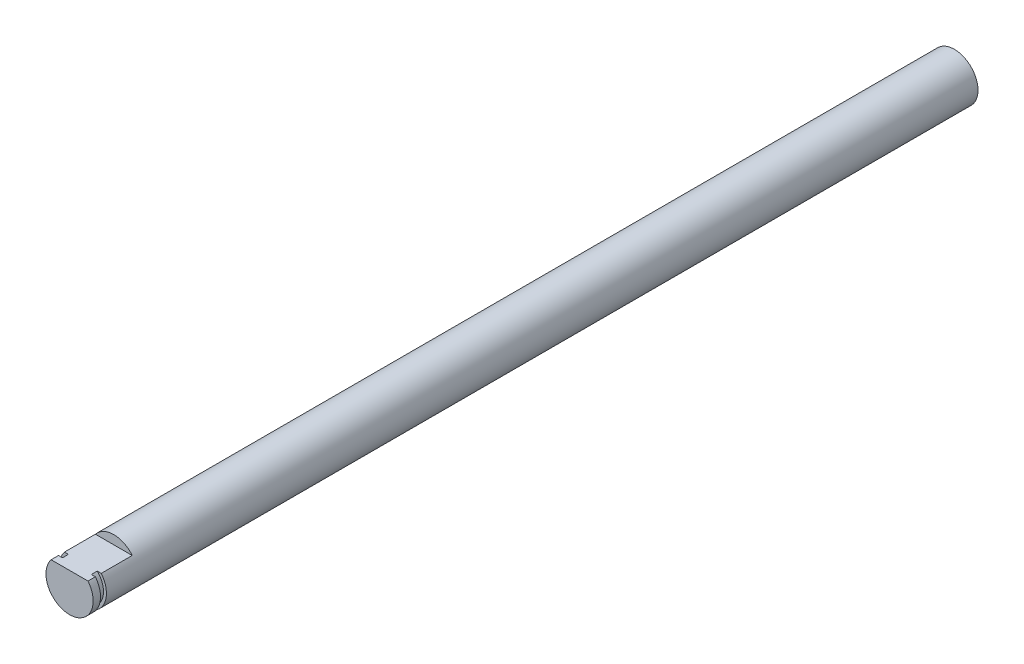
ISO-10303-21;
HEADER;
FILE_DESCRIPTION(('STEP AP214'),'2;1');
FILE_NAME('part.step','',(''),(''),'','','');
FILE_SCHEMA(('AUTOMOTIVE_DESIGN { 1 0 10303 214 1 1 1 1 }'));
ENDSEC;
DATA;
#1=APPLICATION_CONTEXT('core data for automotive mechanical design processes');
#2=APPLICATION_PROTOCOL_DEFINITION('international standard','automotive_design',2000,#1);
#3=PRODUCT_CONTEXT('',#1,'mechanical');
#4=PRODUCT('Part','Part','',(#3));
#5=PRODUCT_RELATED_PRODUCT_CATEGORY('part','',(#4));
#6=PRODUCT_DEFINITION_FORMATION('','',#4);
#7=PRODUCT_DEFINITION_CONTEXT('part definition',#1,'design');
#8=PRODUCT_DEFINITION('design','',#6,#7);
#9=PRODUCT_DEFINITION_SHAPE('','',#8);
#10=(LENGTH_UNIT() NAMED_UNIT(*) SI_UNIT(.MILLI.,.METRE.));
#11=(NAMED_UNIT(*) PLANE_ANGLE_UNIT() SI_UNIT($,.RADIAN.));
#12=(NAMED_UNIT(*) SI_UNIT($,.STERADIAN.) SOLID_ANGLE_UNIT());
#13=UNCERTAINTY_MEASURE_WITH_UNIT(LENGTH_MEASURE(1.E-05),#10,'distance_accuracy_value','');
#14=(GEOMETRIC_REPRESENTATION_CONTEXT(3) GLOBAL_UNCERTAINTY_ASSIGNED_CONTEXT((#13)) GLOBAL_UNIT_ASSIGNED_CONTEXT((#10,
#11,#12)) REPRESENTATION_CONTEXT('',''));
#15=CARTESIAN_POINT('',(0.,0.,0.));
#16=DIRECTION('',(0.,0.,1.));
#17=DIRECTION('',(1.,0.,0.));
#18=AXIS2_PLACEMENT_3D('',#15,#16,#17);
#19=CARTESIAN_POINT('',(0.,0.,150.));
#20=DIRECTION('',(0.,0.,-1.));
#21=DIRECTION('',(-1.,0.,0.));
#22=AXIS2_PLACEMENT_3D('',#19,#20,#21);
#23=CYLINDRICAL_SURFACE('',#22,4.);
#24=CARTESIAN_POINT('',(0.,0.,0.));
#25=DIRECTION('',(0.,0.,1.));
#26=DIRECTION('',(1.,0.,0.));
#27=AXIS2_PLACEMENT_3D('',#24,#25,#26);
#28=CIRCLE('',#27,4.);
#29=CARTESIAN_POINT('',(4.,0.,0.));
#30=VERTEX_POINT('',#29);
#31=EDGE_CURVE('E112',#30,#30,#28,.T.);
#32=ORIENTED_EDGE('',*,*,#31,.T.);
#33=EDGE_LOOP('',(#32));
#34=FACE_BOUND('',#33,.T.);
#35=CARTESIAN_POINT('',(0.,0.,147.75));
#36=DIRECTION('',(0.,0.,1.));
#37=DIRECTION('',(1.,0.,0.));
#38=AXIS2_PLACEMENT_3D('',#35,#36,#37);
#39=CIRCLE('',#38,4.);
#40=CARTESIAN_POINT('',(-3.1224989991992,2.5,147.75));
#41=VERTEX_POINT('',#40);
#42=CARTESIAN_POINT('',(3.1224989991992,2.5,147.75));
#43=VERTEX_POINT('',#42);
#44=EDGE_CURVE('E96',#41,#43,#39,.T.);
#45=ORIENTED_EDGE('',*,*,#44,.F.);
#46=DIRECTION('',(0.,0.,1.));
#47=VECTOR('',#46,1.);
#48=CARTESIAN_POINT('',(-3.1224989991992,2.5,142.5));
#49=LINE('',#48,#47);
#50=CARTESIAN_POINT('',(-3.1224989991992,2.5,142.5));
#51=VERTEX_POINT('',#50);
#52=EDGE_CURVE('E118',#51,#41,#49,.T.);
#53=ORIENTED_EDGE('',*,*,#52,.F.);
#54=CARTESIAN_POINT('',(0.,0.,142.5));
#55=DIRECTION('',(0.,0.,1.));
#56=DIRECTION('',(1.,0.,0.));
#57=AXIS2_PLACEMENT_3D('',#54,#55,#56);
#58=CIRCLE('',#57,4.);
#59=CARTESIAN_POINT('',(3.1224989991992,2.5,142.5));
#60=VERTEX_POINT('',#59);
#61=EDGE_CURVE('E125',#60,#51,#58,.T.);
#62=ORIENTED_EDGE('',*,*,#61,.F.);
#63=DIRECTION('',(0.,0.,1.));
#64=VECTOR('',#63,1.);
#65=CARTESIAN_POINT('',(3.1224989991992,2.5,142.5));
#66=LINE('',#65,#64);
#67=EDGE_CURVE('E115',#60,#43,#66,.T.);
#68=ORIENTED_EDGE('',*,*,#67,.T.);
#69=EDGE_LOOP('',(#45,#53,#62,#68));
#70=FACE_BOUND('',#69,.T.);
#71=ADVANCED_FACE('F35',(#34,#70),#23,.T.);
#72=CARTESIAN_POINT('',(3.1224989991992,2.5,142.5));
#73=DIRECTION('',(0.,-1.,0.));
#74=DIRECTION('',(0.,0.,-1.));
#75=AXIS2_PLACEMENT_3D('',#72,#73,#74);
#76=PLANE('',#75);
#77=DIRECTION('',(-1.,0.,0.));
#78=VECTOR('',#77,1.);
#79=CARTESIAN_POINT('',(3.1224989991992,2.5,147.75));
#80=LINE('',#79,#78);
#81=CARTESIAN_POINT('',(2.44948974278318,2.5,147.75));
#82=VERTEX_POINT('',#81);
#83=EDGE_CURVE('E11',#43,#82,#80,.T.);
#84=ORIENTED_EDGE('',*,*,#83,.F.);
#85=ORIENTED_EDGE('',*,*,#67,.F.);
#86=DIRECTION('',(1.,0.,0.));
#87=VECTOR('',#86,1.);
#88=CARTESIAN_POINT('',(3.1224989991992,2.5,142.5));
#89=LINE('',#88,#87);
#90=EDGE_CURVE('E126',#51,#60,#89,.T.);
#91=ORIENTED_EDGE('',*,*,#90,.F.);
#92=ORIENTED_EDGE('',*,*,#52,.T.);
#93=CARTESIAN_POINT('',(-2.44948974278318,2.5,147.75));
#94=VERTEX_POINT('',#93);
#95=EDGE_CURVE('E45',#94,#41,#80,.T.);
#96=ORIENTED_EDGE('',*,*,#95,.F.);
#97=DIRECTION('',(0.,0.,1.));
#98=VECTOR('',#97,1.);
#99=CARTESIAN_POINT('',(-2.44948974278318,2.5,147.75));
#100=LINE('',#99,#98);
#101=CARTESIAN_POINT('',(-2.44948974278318,2.5,148.75));
#102=VERTEX_POINT('',#101);
#103=EDGE_CURVE('E101',#102,#94,#100,.F.);
#104=ORIENTED_EDGE('',*,*,#103,.F.);
#105=DIRECTION('',(-1.,0.,0.));
#106=VECTOR('',#105,1.);
#107=CARTESIAN_POINT('',(3.1224989991992,2.5,148.75));
#108=LINE('',#107,#106);
#109=CARTESIAN_POINT('',(-3.1224989991992,2.5,148.75));
#110=VERTEX_POINT('',#109);
#111=EDGE_CURVE('E108',#102,#110,#108,.T.);
#112=ORIENTED_EDGE('',*,*,#111,.T.);
#113=CARTESIAN_POINT('',(-3.1224989991992,2.5,150.));
#114=VERTEX_POINT('',#113);
#115=EDGE_CURVE('E60',#110,#114,#49,.T.);
#116=ORIENTED_EDGE('',*,*,#115,.T.);
#117=DIRECTION('',(1.,0.,0.));
#118=VECTOR('',#117,1.);
#119=CARTESIAN_POINT('',(3.1224989991992,2.5,150.));
#120=LINE('',#119,#118);
#121=CARTESIAN_POINT('',(3.1224989991992,2.5,150.));
#122=VERTEX_POINT('',#121);
#123=EDGE_CURVE('E123',#114,#122,#120,.T.);
#124=ORIENTED_EDGE('',*,*,#123,.T.);
#125=CARTESIAN_POINT('',(3.1224989991992,2.5,148.75));
#126=VERTEX_POINT('',#125);
#127=EDGE_CURVE('E121',#126,#122,#66,.T.);
#128=ORIENTED_EDGE('',*,*,#127,.F.);
#129=CARTESIAN_POINT('',(2.44948974278318,2.5,148.75));
#130=VERTEX_POINT('',#129);
#131=EDGE_CURVE('E44',#126,#130,#108,.T.);
#132=ORIENTED_EDGE('',*,*,#131,.T.);
#133=DIRECTION('',(0.,0.,1.));
#134=VECTOR('',#133,1.);
#135=CARTESIAN_POINT('',(2.44948974278318,2.5,147.75));
#136=LINE('',#135,#134);
#137=EDGE_CURVE('E39',#82,#130,#136,.T.);
#138=ORIENTED_EDGE('',*,*,#137,.F.);
#139=EDGE_LOOP('',(#84,#85,#91,#92,#96,#104,#112,#116,#124,#128,#132,#138));
#140=FACE_BOUND('',#139,.T.);
#141=ADVANCED_FACE('F105',(#140),#76,.F.);
#142=ORIENTED_EDGE('',*,*,#115,.F.);
#143=CARTESIAN_POINT('',(0.,0.,148.75));
#144=DIRECTION('',(0.,0.,1.));
#145=DIRECTION('',(1.,0.,0.));
#146=AXIS2_PLACEMENT_3D('',#143,#144,#145);
#147=CIRCLE('',#146,4.);
#148=EDGE_CURVE('E102',#110,#126,#147,.T.);
#149=ORIENTED_EDGE('',*,*,#148,.T.);
#150=ORIENTED_EDGE('',*,*,#127,.T.);
#151=CARTESIAN_POINT('',(0.,0.,150.));
#152=DIRECTION('',(0.,0.,1.));
#153=DIRECTION('',(1.,0.,0.));
#154=AXIS2_PLACEMENT_3D('',#151,#152,#153);
#155=CIRCLE('',#154,4.);
#156=EDGE_CURVE('E111',#114,#122,#155,.T.);
#157=ORIENTED_EDGE('',*,*,#156,.F.);
#158=EDGE_LOOP('',(#142,#149,#150,#157));
#159=FACE_BOUND('',#158,.T.);
#160=ADVANCED_FACE('F37',(#159),#23,.T.);
#161=CARTESIAN_POINT('',(0.,0.,150.));
#162=DIRECTION('',(0.,0.,1.));
#163=DIRECTION('',(1.,0.,0.));
#164=AXIS2_PLACEMENT_3D('',#161,#162,#163);
#165=PLANE('',#164);
#166=ORIENTED_EDGE('',*,*,#123,.F.);
#167=ORIENTED_EDGE('',*,*,#156,.T.);
#168=EDGE_LOOP('',(#166,#167));
#169=FACE_BOUND('',#168,.T.);
#170=ADVANCED_FACE('F149',(#169),#165,.T.);
#171=CARTESIAN_POINT('',(0.,0.,0.));
#172=DIRECTION('',(0.,0.,1.));
#173=DIRECTION('',(1.,0.,0.));
#174=AXIS2_PLACEMENT_3D('',#171,#172,#173);
#175=PLANE('',#174);
#176=ORIENTED_EDGE('',*,*,#31,.F.);
#177=EDGE_LOOP('',(#176));
#178=FACE_BOUND('',#177,.T.);
#179=ADVANCED_FACE('F142',(#178),#175,.F.);
#180=CARTESIAN_POINT('',(0.,0.,142.5));
#181=DIRECTION('',(0.,0.,1.));
#182=DIRECTION('',(1.,0.,0.));
#183=AXIS2_PLACEMENT_3D('',#180,#181,#182);
#184=PLANE('',#183);
#185=ORIENTED_EDGE('',*,*,#61,.T.);
#186=ORIENTED_EDGE('',*,*,#90,.T.);
#187=EDGE_LOOP('',(#185,#186));
#188=FACE_BOUND('',#187,.T.);
#189=ADVANCED_FACE('F140',(#188),#184,.T.);
#190=CARTESIAN_POINT('',(0.,0.,147.75));
#191=DIRECTION('',(0.,0.,1.));
#192=DIRECTION('',(1.,0.,0.));
#193=AXIS2_PLACEMENT_3D('',#190,#191,#192);
#194=PLANE('',#193);
#195=ORIENTED_EDGE('',*,*,#83,.T.);
#196=CARTESIAN_POINT('',(0.,0.,147.75));
#197=DIRECTION('',(0.,0.,1.));
#198=DIRECTION('',(1.,0.,0.));
#199=AXIS2_PLACEMENT_3D('',#196,#197,#198);
#200=CIRCLE('',#199,3.5);
#201=EDGE_CURVE('E93',#94,#82,#200,.T.);
#202=ORIENTED_EDGE('',*,*,#201,.F.);
#203=ORIENTED_EDGE('',*,*,#95,.T.);
#204=ORIENTED_EDGE('',*,*,#44,.T.);
#205=EDGE_LOOP('',(#195,#202,#203,#204));
#206=FACE_BOUND('',#205,.T.);
#207=ADVANCED_FACE('F92',(#206),#194,.T.);
#208=CARTESIAN_POINT('',(0.,0.,148.75));
#209=DIRECTION('',(0.,0.,1.));
#210=DIRECTION('',(1.,0.,0.));
#211=AXIS2_PLACEMENT_3D('',#208,#209,#210);
#212=PLANE('',#211);
#213=ORIENTED_EDGE('',*,*,#148,.F.);
#214=ORIENTED_EDGE('',*,*,#111,.F.);
#215=CARTESIAN_POINT('',(0.,0.,148.75));
#216=DIRECTION('',(0.,0.,1.));
#217=DIRECTION('',(1.,0.,0.));
#218=AXIS2_PLACEMENT_3D('',#215,#216,#217);
#219=CIRCLE('',#218,3.5);
#220=EDGE_CURVE('E52',#102,#130,#219,.T.);
#221=ORIENTED_EDGE('',*,*,#220,.T.);
#222=ORIENTED_EDGE('',*,*,#131,.F.);
#223=EDGE_LOOP('',(#213,#214,#221,#222));
#224=FACE_BOUND('',#223,.T.);
#225=ADVANCED_FACE('F134',(#224),#212,.F.);
#226=CARTESIAN_POINT('',(0.,0.,147.75));
#227=DIRECTION('',(0.,0.,1.));
#228=DIRECTION('',(1.,0.,0.));
#229=AXIS2_PLACEMENT_3D('',#226,#227,#228);
#230=CYLINDRICAL_SURFACE('',#229,3.5);
#231=ORIENTED_EDGE('',*,*,#137,.T.);
#232=ORIENTED_EDGE('',*,*,#220,.F.);
#233=ORIENTED_EDGE('',*,*,#103,.T.);
#234=ORIENTED_EDGE('',*,*,#201,.T.);
#235=EDGE_LOOP('',(#231,#232,#233,#234));
#236=FACE_BOUND('',#235,.T.);
#237=ADVANCED_FACE('F99',(#236),#230,.T.);
#238=CLOSED_SHELL('',(#71,#141,#160,#170,#179,#189,#207,#225,#237));
#239=MANIFOLD_SOLID_BREP('B2',#238);
#240=ADVANCED_BREP_SHAPE_REPRESENTATION('',(#18,#239),#14);
#241=SHAPE_DEFINITION_REPRESENTATION(#9,#240);
ENDSEC;
END-ISO-10303-21;
